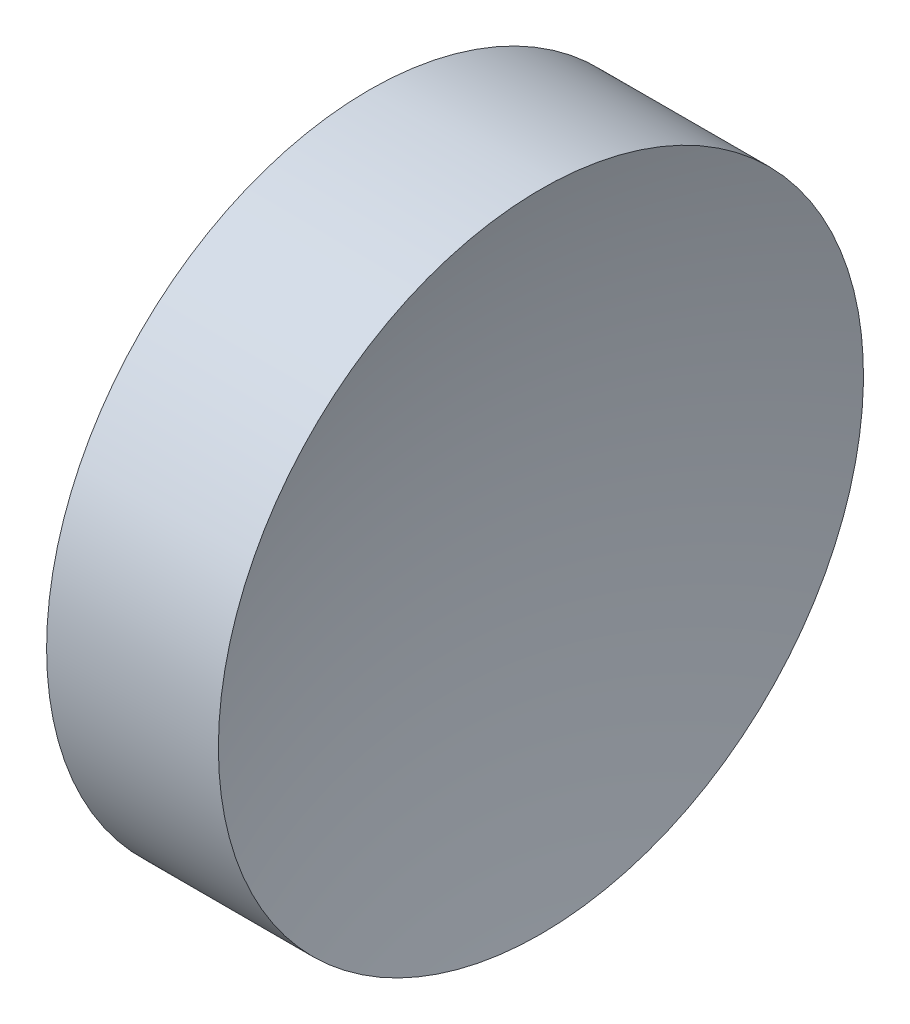
ISO-10303-21;
HEADER;
FILE_DESCRIPTION(('STEP AP214'),'2;1');
FILE_NAME('part.step','',(''),(''),'','','');
FILE_SCHEMA(('AUTOMOTIVE_DESIGN { 1 0 10303 214 1 1 1 1 }'));
ENDSEC;
DATA;
#1=APPLICATION_CONTEXT('core data for automotive mechanical design processes');
#2=APPLICATION_PROTOCOL_DEFINITION('international standard','automotive_design',2000,#1);
#3=PRODUCT_CONTEXT('',#1,'mechanical');
#4=PRODUCT('Part','Part','',(#3));
#5=PRODUCT_RELATED_PRODUCT_CATEGORY('part','',(#4));
#6=PRODUCT_DEFINITION_FORMATION('','',#4);
#7=PRODUCT_DEFINITION_CONTEXT('part definition',#1,'design');
#8=PRODUCT_DEFINITION('design','',#6,#7);
#9=PRODUCT_DEFINITION_SHAPE('','',#8);
#10=(LENGTH_UNIT() NAMED_UNIT(*) SI_UNIT(.MILLI.,.METRE.));
#11=(NAMED_UNIT(*) PLANE_ANGLE_UNIT() SI_UNIT($,.RADIAN.));
#12=(NAMED_UNIT(*) SI_UNIT($,.STERADIAN.) SOLID_ANGLE_UNIT());
#13=UNCERTAINTY_MEASURE_WITH_UNIT(LENGTH_MEASURE(1.E-05),#10,'distance_accuracy_value','');
#14=(GEOMETRIC_REPRESENTATION_CONTEXT(3) GLOBAL_UNCERTAINTY_ASSIGNED_CONTEXT((#13)) GLOBAL_UNIT_ASSIGNED_CONTEXT((#10,
#11,#12)) REPRESENTATION_CONTEXT('',''));
#15=CARTESIAN_POINT('',(0.,0.,0.));
#16=DIRECTION('',(0.,0.,1.));
#17=DIRECTION('',(1.,0.,0.));
#18=AXIS2_PLACEMENT_3D('',#15,#16,#17);
#19=CARTESIAN_POINT('',(50.79044396836,52.1780822983899,0.));
#20=DIRECTION('',(-1.,0.,0.));
#21=DIRECTION('',(0.,1.,0.));
#22=AXIS2_PLACEMENT_3D('',#19,#20,#21);
#23=SPHERICAL_SURFACE('',#22,43.8);
#24=CARTESIAN_POINT('',(92.7088170283918,52.1780822983899,0.));
#25=DIRECTION('',(-1.,0.,0.));
#26=DIRECTION('',(0.,0.,1.));
#27=AXIS2_PLACEMENT_3D('',#24,#25,#26);
#28=CIRCLE('',#27,12.7);
#29=CARTESIAN_POINT('',(92.7088170283918,52.1780822983899,12.7));
#30=VERTEX_POINT('',#29);
#31=EDGE_CURVE('E41',#30,#30,#28,.T.);
#32=ORIENTED_EDGE('',*,*,#31,.T.);
#33=EDGE_LOOP('',(#32));
#34=FACE_BOUND('',#33,.T.);
#35=ADVANCED_FACE('F35',(#34),#23,.F.);
#36=CARTESIAN_POINT('',(141.39044396836,52.1780822983899,0.));
#37=DIRECTION('',(-1.,0.,0.));
#38=DIRECTION('',(0.,-1.,0.));
#39=AXIS2_PLACEMENT_3D('',#36,#37,#38);
#40=SPHERICAL_SURFACE('',#39,43.8);
#41=CARTESIAN_POINT('',(99.4720709083282,52.1780822983899,0.));
#42=DIRECTION('',(-1.,0.,0.));
#43=DIRECTION('',(0.,0.,1.));
#44=AXIS2_PLACEMENT_3D('',#41,#42,#43);
#45=CIRCLE('',#44,12.7);
#46=CARTESIAN_POINT('',(99.4720709083282,52.1780822983899,12.7));
#47=VERTEX_POINT('',#46);
#48=EDGE_CURVE('E10',#47,#47,#45,.T.);
#49=ORIENTED_EDGE('',*,*,#48,.F.);
#50=EDGE_LOOP('',(#49));
#51=FACE_BOUND('',#50,.T.);
#52=ADVANCED_FACE('F50',(#51),#40,.F.);
#53=CARTESIAN_POINT('',(84.8997222282736,52.1780822983899,0.));
#54=DIRECTION('',(-1.,0.,0.));
#55=DIRECTION('',(0.,0.,1.));
#56=AXIS2_PLACEMENT_3D('',#53,#54,#55);
#57=CYLINDRICAL_SURFACE('',#56,12.7);
#58=ORIENTED_EDGE('',*,*,#31,.F.);
#59=EDGE_LOOP('',(#58));
#60=FACE_BOUND('',#59,.T.);
#61=ORIENTED_EDGE('',*,*,#48,.T.);
#62=EDGE_LOOP('',(#61));
#63=FACE_BOUND('',#62,.T.);
#64=ADVANCED_FACE('F48',(#60,#63),#57,.T.);
#65=CLOSED_SHELL('',(#35,#52,#64));
#66=MANIFOLD_SOLID_BREP('B2',#65);
#67=ADVANCED_BREP_SHAPE_REPRESENTATION('',(#18,#66),#14);
#68=SHAPE_DEFINITION_REPRESENTATION(#9,#67);
ENDSEC;
END-ISO-10303-21;
